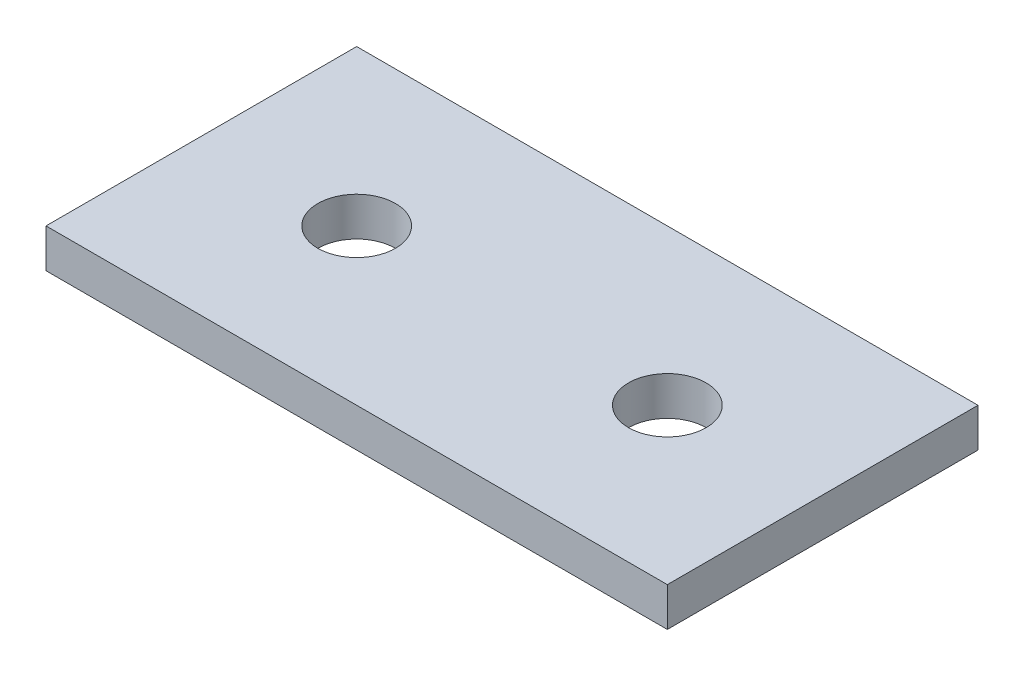
ISO-10303-21;
HEADER;
FILE_DESCRIPTION(('STEP AP214'),'2;1');
FILE_NAME('part.step','',(''),(''),'','','');
FILE_SCHEMA(('AUTOMOTIVE_DESIGN { 1 0 10303 214 1 1 1 1 }'));
ENDSEC;
DATA;
#1=APPLICATION_CONTEXT('core data for automotive mechanical design processes');
#2=APPLICATION_PROTOCOL_DEFINITION('international standard','automotive_design',2000,#1);
#3=PRODUCT_CONTEXT('',#1,'mechanical');
#4=PRODUCT('Part','Part','',(#3));
#5=PRODUCT_RELATED_PRODUCT_CATEGORY('part','',(#4));
#6=PRODUCT_DEFINITION_FORMATION('','',#4);
#7=PRODUCT_DEFINITION_CONTEXT('part definition',#1,'design');
#8=PRODUCT_DEFINITION('design','',#6,#7);
#9=PRODUCT_DEFINITION_SHAPE('','',#8);
#10=(LENGTH_UNIT() NAMED_UNIT(*) SI_UNIT(.MILLI.,.METRE.));
#11=(NAMED_UNIT(*) PLANE_ANGLE_UNIT() SI_UNIT($,.RADIAN.));
#12=(NAMED_UNIT(*) SI_UNIT($,.STERADIAN.) SOLID_ANGLE_UNIT());
#13=UNCERTAINTY_MEASURE_WITH_UNIT(LENGTH_MEASURE(1.E-05),#10,'distance_accuracy_value','');
#14=(GEOMETRIC_REPRESENTATION_CONTEXT(3) GLOBAL_UNCERTAINTY_ASSIGNED_CONTEXT((#13)) GLOBAL_UNIT_ASSIGNED_CONTEXT((#10,
#11,#12)) REPRESENTATION_CONTEXT('',''));
#15=CARTESIAN_POINT('',(0.,0.,0.));
#16=DIRECTION('',(0.,0.,1.));
#17=DIRECTION('',(1.,0.,0.));
#18=AXIS2_PLACEMENT_3D('',#15,#16,#17);
#19=CARTESIAN_POINT('',(0.,3.175,0.));
#20=DIRECTION('',(0.,-1.,0.));
#21=DIRECTION('',(0.,0.,-1.));
#22=AXIS2_PLACEMENT_3D('',#19,#20,#21);
#23=PLANE('',#22);
#24=DIRECTION('',(0.,0.,1.));
#25=VECTOR('',#24,1.);
#26=CARTESIAN_POINT('',(0.,3.175,0.));
#27=LINE('',#26,#25);
#28=CARTESIAN_POINT('',(0.,3.175,-25.4));
#29=VERTEX_POINT('',#28);
#30=CARTESIAN_POINT('',(0.,3.175,0.));
#31=VERTEX_POINT('',#30);
#32=EDGE_CURVE('E85',#29,#31,#27,.T.);
#33=ORIENTED_EDGE('',*,*,#32,.T.);
#34=DIRECTION('',(1.,0.,0.));
#35=VECTOR('',#34,1.);
#36=CARTESIAN_POINT('',(0.,3.175,0.));
#37=LINE('',#36,#35);
#38=CARTESIAN_POINT('',(50.8,3.175,0.));
#39=VERTEX_POINT('',#38);
#40=EDGE_CURVE('E80',#31,#39,#37,.T.);
#41=ORIENTED_EDGE('',*,*,#40,.T.);
#42=DIRECTION('',(0.,0.,-1.));
#43=VECTOR('',#42,1.);
#44=CARTESIAN_POINT('',(50.8,3.175,0.));
#45=LINE('',#44,#43);
#46=CARTESIAN_POINT('',(50.8,3.175,-25.4));
#47=VERTEX_POINT('',#46);
#48=EDGE_CURVE('E83',#39,#47,#45,.T.);
#49=ORIENTED_EDGE('',*,*,#48,.T.);
#50=DIRECTION('',(-1.,0.,0.));
#51=VECTOR('',#50,1.);
#52=CARTESIAN_POINT('',(0.,3.175,-25.4));
#53=LINE('',#52,#51);
#54=EDGE_CURVE('E50',#47,#29,#53,.T.);
#55=ORIENTED_EDGE('',*,*,#54,.T.);
#56=EDGE_LOOP('',(#33,#41,#49,#55));
#57=FACE_BOUND('',#56,.T.);
#58=CARTESIAN_POINT('',(12.7,3.175,-12.7));
#59=DIRECTION('',(0.,1.,0.));
#60=DIRECTION('',(0.,0.,1.));
#61=AXIS2_PLACEMENT_3D('',#58,#59,#60);
#62=CIRCLE('',#61,3.175);
#63=CARTESIAN_POINT('',(12.7,3.175,-9.525));
#64=VERTEX_POINT('',#63);
#65=EDGE_CURVE('E100',#64,#64,#62,.T.);
#66=ORIENTED_EDGE('',*,*,#65,.F.);
#67=EDGE_LOOP('',(#66));
#68=FACE_BOUND('',#67,.T.);
#69=CARTESIAN_POINT('',(38.1,3.175,-12.7));
#70=DIRECTION('',(0.,1.,0.));
#71=DIRECTION('',(0.,0.,1.));
#72=AXIS2_PLACEMENT_3D('',#69,#70,#71);
#73=CIRCLE('',#72,3.175);
#74=CARTESIAN_POINT('',(38.1,3.175,-9.525));
#75=VERTEX_POINT('',#74);
#76=EDGE_CURVE('E115',#75,#75,#73,.T.);
#77=ORIENTED_EDGE('',*,*,#76,.F.);
#78=EDGE_LOOP('',(#77));
#79=FACE_BOUND('',#78,.T.);
#80=ADVANCED_FACE('F33',(#57,#68,#79),#23,.F.);
#81=CARTESIAN_POINT('',(0.,0.,0.));
#82=DIRECTION('',(0.,-1.,0.));
#83=DIRECTION('',(0.,0.,-1.));
#84=AXIS2_PLACEMENT_3D('',#81,#82,#83);
#85=PLANE('',#84);
#86=CARTESIAN_POINT('',(12.7,0.,-12.7));
#87=DIRECTION('',(0.,1.,0.));
#88=DIRECTION('',(0.,0.,1.));
#89=AXIS2_PLACEMENT_3D('',#86,#87,#88);
#90=CIRCLE('',#89,3.175);
#91=CARTESIAN_POINT('',(12.7,0.,-9.525));
#92=VERTEX_POINT('',#91);
#93=EDGE_CURVE('E112',#92,#92,#90,.T.);
#94=ORIENTED_EDGE('',*,*,#93,.T.);
#95=EDGE_LOOP('',(#94));
#96=FACE_BOUND('',#95,.T.);
#97=DIRECTION('',(0.,0.,1.));
#98=VECTOR('',#97,1.);
#99=CARTESIAN_POINT('',(0.,0.,0.));
#100=LINE('',#99,#98);
#101=CARTESIAN_POINT('',(0.,0.,-25.4));
#102=VERTEX_POINT('',#101);
#103=CARTESIAN_POINT('',(0.,0.,0.));
#104=VERTEX_POINT('',#103);
#105=EDGE_CURVE('E97',#102,#104,#100,.T.);
#106=ORIENTED_EDGE('',*,*,#105,.F.);
#107=DIRECTION('',(-1.,0.,0.));
#108=VECTOR('',#107,1.);
#109=CARTESIAN_POINT('',(0.,0.,-25.4));
#110=LINE('',#109,#108);
#111=CARTESIAN_POINT('',(50.8,0.,-25.4));
#112=VERTEX_POINT('',#111);
#113=EDGE_CURVE('E73',#112,#102,#110,.T.);
#114=ORIENTED_EDGE('',*,*,#113,.F.);
#115=DIRECTION('',(0.,0.,-1.));
#116=VECTOR('',#115,1.);
#117=CARTESIAN_POINT('',(50.8,0.,0.));
#118=LINE('',#117,#116);
#119=CARTESIAN_POINT('',(50.8,0.,0.));
#120=VERTEX_POINT('',#119);
#121=EDGE_CURVE('E67',#120,#112,#118,.T.);
#122=ORIENTED_EDGE('',*,*,#121,.F.);
#123=DIRECTION('',(1.,0.,0.));
#124=VECTOR('',#123,1.);
#125=CARTESIAN_POINT('',(0.,0.,0.));
#126=LINE('',#125,#124);
#127=EDGE_CURVE('E89',#104,#120,#126,.T.);
#128=ORIENTED_EDGE('',*,*,#127,.F.);
#129=EDGE_LOOP('',(#106,#114,#122,#128));
#130=FACE_BOUND('',#129,.T.);
#131=CARTESIAN_POINT('',(38.1,0.,-12.7));
#132=DIRECTION('',(0.,1.,0.));
#133=DIRECTION('',(0.,0.,1.));
#134=AXIS2_PLACEMENT_3D('',#131,#132,#133);
#135=CIRCLE('',#134,3.175);
#136=CARTESIAN_POINT('',(38.1,0.,-9.525));
#137=VERTEX_POINT('',#136);
#138=EDGE_CURVE('E118',#137,#137,#135,.T.);
#139=ORIENTED_EDGE('',*,*,#138,.T.);
#140=EDGE_LOOP('',(#139));
#141=FACE_BOUND('',#140,.T.);
#142=ADVANCED_FACE('F108',(#96,#130,#141),#85,.T.);
#143=CARTESIAN_POINT('',(0.,3.175,0.));
#144=DIRECTION('',(1.,0.,0.));
#145=DIRECTION('',(0.,0.,-1.));
#146=AXIS2_PLACEMENT_3D('',#143,#144,#145);
#147=PLANE('',#146);
#148=ORIENTED_EDGE('',*,*,#105,.T.);
#149=DIRECTION('',(0.,-1.,0.));
#150=VECTOR('',#149,1.);
#151=CARTESIAN_POINT('',(0.,3.175,0.));
#152=LINE('',#151,#150);
#153=EDGE_CURVE('E11',#31,#104,#152,.T.);
#154=ORIENTED_EDGE('',*,*,#153,.F.);
#155=ORIENTED_EDGE('',*,*,#32,.F.);
#156=DIRECTION('',(0.,-1.,0.));
#157=VECTOR('',#156,1.);
#158=CARTESIAN_POINT('',(0.,3.175,-25.4));
#159=LINE('',#158,#157);
#160=EDGE_CURVE('E93',#29,#102,#159,.T.);
#161=ORIENTED_EDGE('',*,*,#160,.T.);
#162=EDGE_LOOP('',(#148,#154,#155,#161));
#163=FACE_BOUND('',#162,.T.);
#164=ADVANCED_FACE('F35',(#163),#147,.F.);
#165=CARTESIAN_POINT('',(0.,3.175,0.));
#166=DIRECTION('',(0.,0.,-1.));
#167=DIRECTION('',(-1.,0.,0.));
#168=AXIS2_PLACEMENT_3D('',#165,#166,#167);
#169=PLANE('',#168);
#170=ORIENTED_EDGE('',*,*,#127,.T.);
#171=DIRECTION('',(0.,-1.,0.));
#172=VECTOR('',#171,1.);
#173=CARTESIAN_POINT('',(50.8,3.175,0.));
#174=LINE('',#173,#172);
#175=EDGE_CURVE('E42',#39,#120,#174,.T.);
#176=ORIENTED_EDGE('',*,*,#175,.F.);
#177=ORIENTED_EDGE('',*,*,#40,.F.);
#178=ORIENTED_EDGE('',*,*,#153,.T.);
#179=EDGE_LOOP('',(#170,#176,#177,#178));
#180=FACE_BOUND('',#179,.T.);
#181=ADVANCED_FACE('F88',(#180),#169,.F.);
#182=CARTESIAN_POINT('',(50.8,3.175,0.));
#183=DIRECTION('',(-1.,0.,0.));
#184=DIRECTION('',(0.,0.,1.));
#185=AXIS2_PLACEMENT_3D('',#182,#183,#184);
#186=PLANE('',#185);
#187=ORIENTED_EDGE('',*,*,#121,.T.);
#188=DIRECTION('',(0.,-1.,0.));
#189=VECTOR('',#188,1.);
#190=CARTESIAN_POINT('',(50.8,3.175,-25.4));
#191=LINE('',#190,#189);
#192=EDGE_CURVE('E90',#47,#112,#191,.T.);
#193=ORIENTED_EDGE('',*,*,#192,.F.);
#194=ORIENTED_EDGE('',*,*,#48,.F.);
#195=ORIENTED_EDGE('',*,*,#175,.T.);
#196=EDGE_LOOP('',(#187,#193,#194,#195));
#197=FACE_BOUND('',#196,.T.);
#198=ADVANCED_FACE('F91',(#197),#186,.F.);
#199=CARTESIAN_POINT('',(0.,3.175,-25.4));
#200=DIRECTION('',(0.,0.,1.));
#201=DIRECTION('',(1.,0.,0.));
#202=AXIS2_PLACEMENT_3D('',#199,#200,#201);
#203=PLANE('',#202);
#204=ORIENTED_EDGE('',*,*,#113,.T.);
#205=ORIENTED_EDGE('',*,*,#160,.F.);
#206=ORIENTED_EDGE('',*,*,#54,.F.);
#207=ORIENTED_EDGE('',*,*,#192,.T.);
#208=EDGE_LOOP('',(#204,#205,#206,#207));
#209=FACE_BOUND('',#208,.T.);
#210=ADVANCED_FACE('F105',(#209),#203,.F.);
#211=CARTESIAN_POINT('',(12.7,3.175,-12.7));
#212=DIRECTION('',(0.,-1.,0.));
#213=DIRECTION('',(0.,0.,-1.));
#214=AXIS2_PLACEMENT_3D('',#211,#212,#213);
#215=CYLINDRICAL_SURFACE('',#214,3.175);
#216=ORIENTED_EDGE('',*,*,#65,.T.);
#217=EDGE_LOOP('',(#216));
#218=FACE_BOUND('',#217,.T.);
#219=ORIENTED_EDGE('',*,*,#93,.F.);
#220=EDGE_LOOP('',(#219));
#221=FACE_BOUND('',#220,.T.);
#222=ADVANCED_FACE('F135',(#218,#221),#215,.F.);
#223=CARTESIAN_POINT('',(38.1,3.175,-12.7));
#224=DIRECTION('',(0.,-1.,0.));
#225=DIRECTION('',(0.,0.,-1.));
#226=AXIS2_PLACEMENT_3D('',#223,#224,#225);
#227=CYLINDRICAL_SURFACE('',#226,3.175);
#228=ORIENTED_EDGE('',*,*,#76,.T.);
#229=EDGE_LOOP('',(#228));
#230=FACE_BOUND('',#229,.T.);
#231=ORIENTED_EDGE('',*,*,#138,.F.);
#232=EDGE_LOOP('',(#231));
#233=FACE_BOUND('',#232,.T.);
#234=ADVANCED_FACE('F124',(#230,#233),#227,.F.);
#235=CLOSED_SHELL('',(#80,#142,#164,#181,#198,#210,#222,#234));
#236=MANIFOLD_SOLID_BREP('B2',#235);
#237=ADVANCED_BREP_SHAPE_REPRESENTATION('',(#18,#236),#14);
#238=SHAPE_DEFINITION_REPRESENTATION(#9,#237);
ENDSEC;
END-ISO-10303-21;
